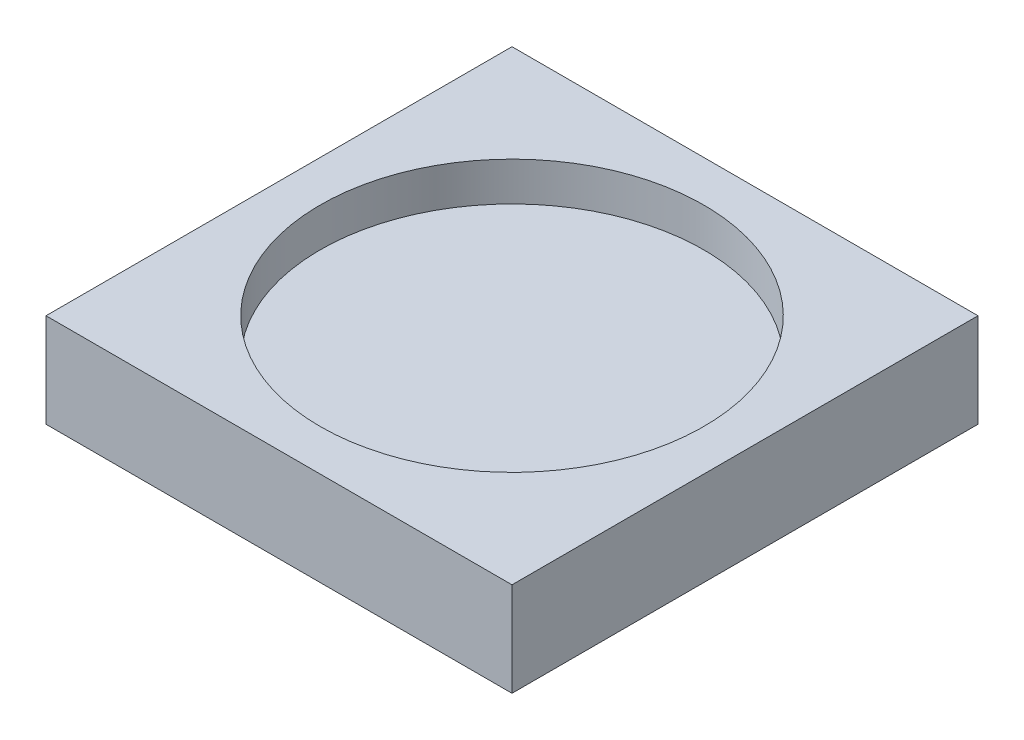
ISO-10303-21;
HEADER;
FILE_DESCRIPTION(('STEP AP214'),'2;1');
FILE_NAME('part.step','',(''),(''),'','','');
FILE_SCHEMA(('AUTOMOTIVE_DESIGN { 1 0 10303 214 1 1 1 1 }'));
ENDSEC;
DATA;
#1=APPLICATION_CONTEXT('core data for automotive mechanical design processes');
#2=APPLICATION_PROTOCOL_DEFINITION('international standard','automotive_design',2000,#1);
#3=PRODUCT_CONTEXT('',#1,'mechanical');
#4=PRODUCT('Part','Part','',(#3));
#5=PRODUCT_RELATED_PRODUCT_CATEGORY('part','',(#4));
#6=PRODUCT_DEFINITION_FORMATION('','',#4);
#7=PRODUCT_DEFINITION_CONTEXT('part definition',#1,'design');
#8=PRODUCT_DEFINITION('design','',#6,#7);
#9=PRODUCT_DEFINITION_SHAPE('','',#8);
#10=(LENGTH_UNIT() NAMED_UNIT(*) SI_UNIT(.MILLI.,.METRE.));
#11=(NAMED_UNIT(*) PLANE_ANGLE_UNIT() SI_UNIT($,.RADIAN.));
#12=(NAMED_UNIT(*) SI_UNIT($,.STERADIAN.) SOLID_ANGLE_UNIT());
#13=UNCERTAINTY_MEASURE_WITH_UNIT(LENGTH_MEASURE(1.E-05),#10,'distance_accuracy_value','');
#14=(GEOMETRIC_REPRESENTATION_CONTEXT(3) GLOBAL_UNCERTAINTY_ASSIGNED_CONTEXT((#13)) GLOBAL_UNIT_ASSIGNED_CONTEXT((#10,
#11,#12)) REPRESENTATION_CONTEXT('',''));
#15=CARTESIAN_POINT('',(0.,0.,0.));
#16=DIRECTION('',(0.,0.,1.));
#17=DIRECTION('',(1.,0.,0.));
#18=AXIS2_PLACEMENT_3D('',#15,#16,#17);
#19=CARTESIAN_POINT('',(0.,30.734,0.));
#20=DIRECTION('',(1.,0.,0.));
#21=DIRECTION('',(0.,0.,-1.));
#22=AXIS2_PLACEMENT_3D('',#19,#20,#21);
#23=PLANE('',#22);
#24=DIRECTION('',(0.,0.,1.));
#25=VECTOR('',#24,1.);
#26=CARTESIAN_POINT('',(0.,0.,0.));
#27=LINE('',#26,#25);
#28=CARTESIAN_POINT('',(0.,0.,-152.4));
#29=VERTEX_POINT('',#28);
#30=CARTESIAN_POINT('',(0.,0.,0.));
#31=VERTEX_POINT('',#30);
#32=EDGE_CURVE('E96',#29,#31,#27,.T.);
#33=ORIENTED_EDGE('',*,*,#32,.T.);
#34=DIRECTION('',(0.,-1.,0.));
#35=VECTOR('',#34,1.);
#36=CARTESIAN_POINT('',(0.,30.734,0.));
#37=LINE('',#36,#35);
#38=CARTESIAN_POINT('',(0.,30.734,0.));
#39=VERTEX_POINT('',#38);
#40=EDGE_CURVE('E11',#39,#31,#37,.T.);
#41=ORIENTED_EDGE('',*,*,#40,.F.);
#42=DIRECTION('',(0.,0.,1.));
#43=VECTOR('',#42,1.);
#44=CARTESIAN_POINT('',(0.,30.734,0.));
#45=LINE('',#44,#43);
#46=CARTESIAN_POINT('',(0.,30.734,-152.4));
#47=VERTEX_POINT('',#46);
#48=EDGE_CURVE('E84',#47,#39,#45,.T.);
#49=ORIENTED_EDGE('',*,*,#48,.F.);
#50=DIRECTION('',(0.,-1.,0.));
#51=VECTOR('',#50,1.);
#52=CARTESIAN_POINT('',(0.,30.734,-152.4));
#53=LINE('',#52,#51);
#54=EDGE_CURVE('E92',#47,#29,#53,.T.);
#55=ORIENTED_EDGE('',*,*,#54,.T.);
#56=EDGE_LOOP('',(#33,#41,#49,#55));
#57=FACE_BOUND('',#56,.T.);
#58=ADVANCED_FACE('F33',(#57),#23,.F.);
#59=CARTESIAN_POINT('',(0.,30.734,0.));
#60=DIRECTION('',(0.,0.,-1.));
#61=DIRECTION('',(-1.,0.,0.));
#62=AXIS2_PLACEMENT_3D('',#59,#60,#61);
#63=PLANE('',#62);
#64=DIRECTION('',(1.,0.,0.));
#65=VECTOR('',#64,1.);
#66=CARTESIAN_POINT('',(0.,0.,0.));
#67=LINE('',#66,#65);
#68=CARTESIAN_POINT('',(152.4,0.,0.));
#69=VERTEX_POINT('',#68);
#70=EDGE_CURVE('E88',#31,#69,#67,.T.);
#71=ORIENTED_EDGE('',*,*,#70,.T.);
#72=DIRECTION('',(0.,-1.,0.));
#73=VECTOR('',#72,1.);
#74=CARTESIAN_POINT('',(152.4,30.734,0.));
#75=LINE('',#74,#73);
#76=CARTESIAN_POINT('',(152.4,30.734,0.));
#77=VERTEX_POINT('',#76);
#78=EDGE_CURVE('E41',#77,#69,#75,.T.);
#79=ORIENTED_EDGE('',*,*,#78,.F.);
#80=DIRECTION('',(1.,0.,0.));
#81=VECTOR('',#80,1.);
#82=CARTESIAN_POINT('',(0.,30.734,0.));
#83=LINE('',#82,#81);
#84=EDGE_CURVE('E79',#39,#77,#83,.T.);
#85=ORIENTED_EDGE('',*,*,#84,.F.);
#86=ORIENTED_EDGE('',*,*,#40,.T.);
#87=EDGE_LOOP('',(#71,#79,#85,#86));
#88=FACE_BOUND('',#87,.T.);
#89=ADVANCED_FACE('F87',(#88),#63,.F.);
#90=CARTESIAN_POINT('',(152.4,30.734,0.));
#91=DIRECTION('',(-1.,0.,0.));
#92=DIRECTION('',(0.,0.,1.));
#93=AXIS2_PLACEMENT_3D('',#90,#91,#92);
#94=PLANE('',#93);
#95=DIRECTION('',(0.,0.,-1.));
#96=VECTOR('',#95,1.);
#97=CARTESIAN_POINT('',(152.4,0.,0.));
#98=LINE('',#97,#96);
#99=CARTESIAN_POINT('',(152.4,0.,-152.4));
#100=VERTEX_POINT('',#99);
#101=EDGE_CURVE('E66',#69,#100,#98,.T.);
#102=ORIENTED_EDGE('',*,*,#101,.T.);
#103=DIRECTION('',(0.,-1.,0.));
#104=VECTOR('',#103,1.);
#105=CARTESIAN_POINT('',(152.4,30.734,-152.4));
#106=LINE('',#105,#104);
#107=CARTESIAN_POINT('',(152.4,30.734,-152.4));
#108=VERTEX_POINT('',#107);
#109=EDGE_CURVE('E89',#108,#100,#106,.T.);
#110=ORIENTED_EDGE('',*,*,#109,.F.);
#111=DIRECTION('',(0.,0.,-1.));
#112=VECTOR('',#111,1.);
#113=CARTESIAN_POINT('',(152.4,30.734,0.));
#114=LINE('',#113,#112);
#115=EDGE_CURVE('E82',#77,#108,#114,.T.);
#116=ORIENTED_EDGE('',*,*,#115,.F.);
#117=ORIENTED_EDGE('',*,*,#78,.T.);
#118=EDGE_LOOP('',(#102,#110,#116,#117));
#119=FACE_BOUND('',#118,.T.);
#120=ADVANCED_FACE('F90',(#119),#94,.F.);
#121=CARTESIAN_POINT('',(0.,30.734,-152.4));
#122=DIRECTION('',(0.,0.,1.));
#123=DIRECTION('',(1.,0.,0.));
#124=AXIS2_PLACEMENT_3D('',#121,#122,#123);
#125=PLANE('',#124);
#126=DIRECTION('',(-1.,0.,0.));
#127=VECTOR('',#126,1.);
#128=CARTESIAN_POINT('',(0.,0.,-152.4));
#129=LINE('',#128,#127);
#130=EDGE_CURVE('E72',#100,#29,#129,.T.);
#131=ORIENTED_EDGE('',*,*,#130,.T.);
#132=ORIENTED_EDGE('',*,*,#54,.F.);
#133=DIRECTION('',(-1.,0.,0.));
#134=VECTOR('',#133,1.);
#135=CARTESIAN_POINT('',(0.,30.734,-152.4));
#136=LINE('',#135,#134);
#137=EDGE_CURVE('E49',#108,#47,#136,.T.);
#138=ORIENTED_EDGE('',*,*,#137,.F.);
#139=ORIENTED_EDGE('',*,*,#109,.T.);
#140=EDGE_LOOP('',(#131,#132,#138,#139));
#141=FACE_BOUND('',#140,.T.);
#142=ADVANCED_FACE('F104',(#141),#125,.F.);
#143=CARTESIAN_POINT('',(0.,30.734,0.));
#144=DIRECTION('',(0.,-1.,0.));
#145=DIRECTION('',(0.,0.,-1.));
#146=AXIS2_PLACEMENT_3D('',#143,#144,#145);
#147=PLANE('',#146);
#148=CARTESIAN_POINT('',(76.2,30.734,-76.2));
#149=DIRECTION('',(0.,1.,0.));
#150=DIRECTION('',(0.,0.,1.));
#151=AXIS2_PLACEMENT_3D('',#148,#149,#150);
#152=CIRCLE('',#151,62.738);
#153=CARTESIAN_POINT('',(76.2,30.734,-13.462));
#154=VERTEX_POINT('',#153);
#155=EDGE_CURVE('E110',#154,#154,#152,.T.);
#156=ORIENTED_EDGE('',*,*,#155,.F.);
#157=EDGE_LOOP('',(#156));
#158=FACE_BOUND('',#157,.T.);
#159=ORIENTED_EDGE('',*,*,#48,.T.);
#160=ORIENTED_EDGE('',*,*,#84,.T.);
#161=ORIENTED_EDGE('',*,*,#115,.T.);
#162=ORIENTED_EDGE('',*,*,#137,.T.);
#163=EDGE_LOOP('',(#159,#160,#161,#162));
#164=FACE_BOUND('',#163,.T.);
#165=ADVANCED_FACE('F80',(#158,#164),#147,.F.);
#166=CARTESIAN_POINT('',(0.,0.,0.));
#167=DIRECTION('',(0.,-1.,0.));
#168=DIRECTION('',(0.,0.,-1.));
#169=AXIS2_PLACEMENT_3D('',#166,#167,#168);
#170=PLANE('',#169);
#171=ORIENTED_EDGE('',*,*,#32,.F.);
#172=ORIENTED_EDGE('',*,*,#130,.F.);
#173=ORIENTED_EDGE('',*,*,#101,.F.);
#174=ORIENTED_EDGE('',*,*,#70,.F.);
#175=EDGE_LOOP('',(#171,#172,#173,#174));
#176=FACE_BOUND('',#175,.T.);
#177=ADVANCED_FACE('F107',(#176),#170,.T.);
#178=CARTESIAN_POINT('',(76.2,18.034,-76.2));
#179=DIRECTION('',(0.,1.,0.));
#180=DIRECTION('',(0.,0.,1.));
#181=AXIS2_PLACEMENT_3D('',#178,#179,#180);
#182=CYLINDRICAL_SURFACE('',#181,62.738);
#183=CARTESIAN_POINT('',(76.2,18.034,-76.2));
#184=DIRECTION('',(0.,1.,0.));
#185=DIRECTION('',(0.,0.,1.));
#186=AXIS2_PLACEMENT_3D('',#183,#184,#185);
#187=CIRCLE('',#186,62.738);
#188=CARTESIAN_POINT('',(76.2,18.034,-13.462));
#189=VERTEX_POINT('',#188);
#190=EDGE_CURVE('E99',#189,#189,#187,.T.);
#191=ORIENTED_EDGE('',*,*,#190,.F.);
#192=EDGE_LOOP('',(#191));
#193=FACE_BOUND('',#192,.T.);
#194=ORIENTED_EDGE('',*,*,#155,.T.);
#195=EDGE_LOOP('',(#194));
#196=FACE_BOUND('',#195,.T.);
#197=ADVANCED_FACE('F118',(#193,#196),#182,.F.);
#198=CARTESIAN_POINT('',(76.2,18.034,-76.2));
#199=DIRECTION('',(0.,1.,0.));
#200=DIRECTION('',(0.,0.,1.));
#201=AXIS2_PLACEMENT_3D('',#198,#199,#200);
#202=PLANE('',#201);
#203=ORIENTED_EDGE('',*,*,#190,.T.);
#204=EDGE_LOOP('',(#203));
#205=FACE_BOUND('',#204,.T.);
#206=ADVANCED_FACE('F116',(#205),#202,.T.);
#207=CLOSED_SHELL('',(#58,#89,#120,#142,#165,#177,#197,#206));
#208=MANIFOLD_SOLID_BREP('B2',#207);
#209=ADVANCED_BREP_SHAPE_REPRESENTATION('',(#18,#208),#14);
#210=SHAPE_DEFINITION_REPRESENTATION(#9,#209);
ENDSEC;
END-ISO-10303-21;
